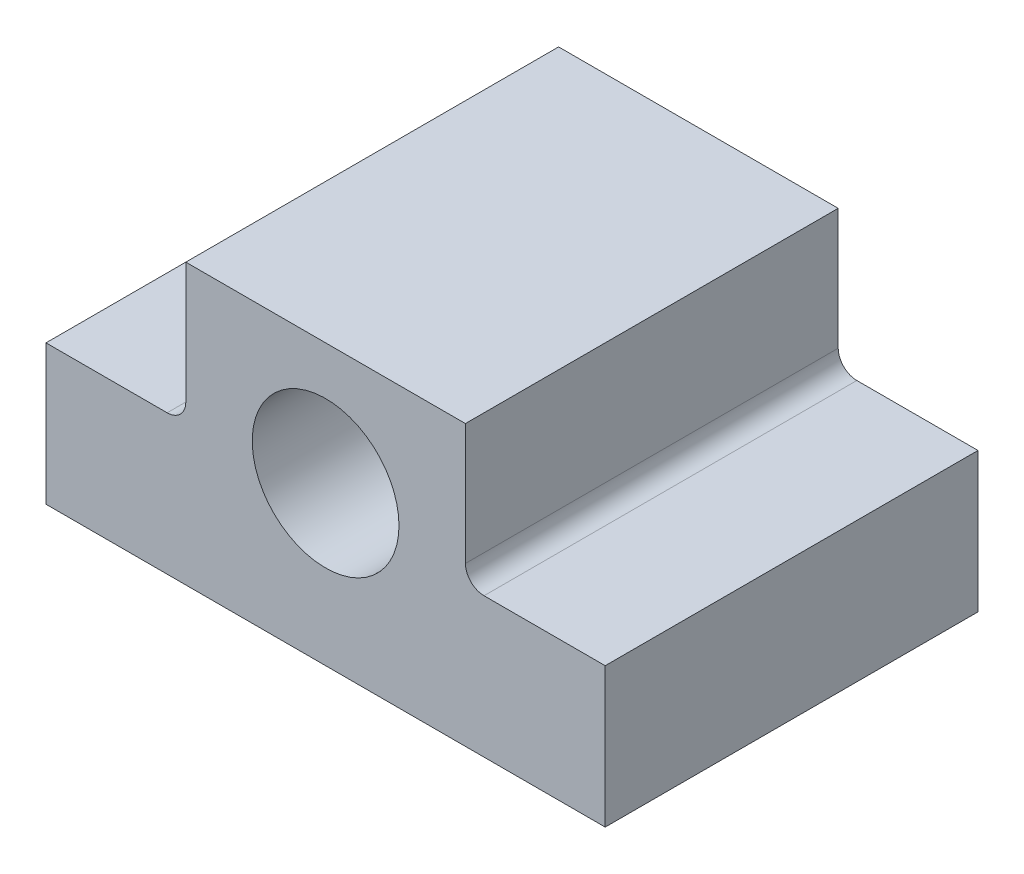
ISO-10303-21;
HEADER;
FILE_DESCRIPTION(('STEP AP214'),'2;1');
FILE_NAME('part.step','',(''),(''),'','','');
FILE_SCHEMA(('AUTOMOTIVE_DESIGN { 1 0 10303 214 1 1 1 1 }'));
ENDSEC;
DATA;
#1=APPLICATION_CONTEXT('core data for automotive mechanical design processes');
#2=APPLICATION_PROTOCOL_DEFINITION('international standard','automotive_design',2000,#1);
#3=PRODUCT_CONTEXT('',#1,'mechanical');
#4=PRODUCT('Part','Part','',(#3));
#5=PRODUCT_RELATED_PRODUCT_CATEGORY('part','',(#4));
#6=PRODUCT_DEFINITION_FORMATION('','',#4);
#7=PRODUCT_DEFINITION_CONTEXT('part definition',#1,'design');
#8=PRODUCT_DEFINITION('design','',#6,#7);
#9=PRODUCT_DEFINITION_SHAPE('','',#8);
#10=(LENGTH_UNIT() NAMED_UNIT(*) SI_UNIT(.MILLI.,.METRE.));
#11=(NAMED_UNIT(*) PLANE_ANGLE_UNIT() SI_UNIT($,.RADIAN.));
#12=(NAMED_UNIT(*) SI_UNIT($,.STERADIAN.) SOLID_ANGLE_UNIT());
#13=UNCERTAINTY_MEASURE_WITH_UNIT(LENGTH_MEASURE(1.E-05),#10,'distance_accuracy_value','');
#14=(GEOMETRIC_REPRESENTATION_CONTEXT(3) GLOBAL_UNCERTAINTY_ASSIGNED_CONTEXT((#13)) GLOBAL_UNIT_ASSIGNED_CONTEXT((#10,
#11,#12)) REPRESENTATION_CONTEXT('',''));
#15=CARTESIAN_POINT('',(0.,0.,0.));
#16=DIRECTION('',(0.,0.,1.));
#17=DIRECTION('',(1.,0.,0.));
#18=AXIS2_PLACEMENT_3D('',#15,#16,#17);
#19=CARTESIAN_POINT('',(0.,0.,12.7));
#20=DIRECTION('',(0.,0.,1.));
#21=DIRECTION('',(1.,0.,0.));
#22=AXIS2_PLACEMENT_3D('',#19,#20,#21);
#23=PLANE('',#22);
#24=DIRECTION('',(0.,-1.,0.));
#25=VECTOR('',#24,1.);
#26=CARTESIAN_POINT('',(-19.05,9.525,12.7));
#27=LINE('',#26,#25);
#28=CARTESIAN_POINT('',(-19.05,9.525,12.7));
#29=VERTEX_POINT('',#28);
#30=CARTESIAN_POINT('',(-19.05,0.,12.7));
#31=VERTEX_POINT('',#30);
#32=EDGE_CURVE('E121',#29,#31,#27,.T.);
#33=ORIENTED_EDGE('',*,*,#32,.T.);
#34=DIRECTION('',(1.,0.,0.));
#35=VECTOR('',#34,1.);
#36=CARTESIAN_POINT('',(-19.05,0.,12.7));
#37=LINE('',#36,#35);
#38=CARTESIAN_POINT('',(19.05,0.,12.7));
#39=VERTEX_POINT('',#38);
#40=EDGE_CURVE('E110',#31,#39,#37,.T.);
#41=ORIENTED_EDGE('',*,*,#40,.T.);
#42=DIRECTION('',(0.,1.,0.));
#43=VECTOR('',#42,1.);
#44=CARTESIAN_POINT('',(19.05,0.,12.7));
#45=LINE('',#44,#43);
#46=CARTESIAN_POINT('',(19.05,9.525,12.7));
#47=VERTEX_POINT('',#46);
#48=EDGE_CURVE('E120',#39,#47,#45,.T.);
#49=ORIENTED_EDGE('',*,*,#48,.T.);
#50=DIRECTION('',(-1.,0.,0.));
#51=VECTOR('',#50,1.);
#52=CARTESIAN_POINT('',(19.05,9.525,12.7));
#53=LINE('',#52,#51);
#54=CARTESIAN_POINT('',(10.795,9.525,12.7));
#55=VERTEX_POINT('',#54);
#56=EDGE_CURVE('E158',#47,#55,#53,.T.);
#57=ORIENTED_EDGE('',*,*,#56,.T.);
#58=CARTESIAN_POINT('',(10.795,10.795,12.7));
#59=DIRECTION('',(0.,0.,1.));
#60=DIRECTION('',(1.,0.,0.));
#61=AXIS2_PLACEMENT_3D('',#58,#59,#60);
#62=CIRCLE('',#61,1.27);
#63=CARTESIAN_POINT('',(9.525,10.795,12.7));
#64=VERTEX_POINT('',#63);
#65=EDGE_CURVE('E151',#55,#64,#62,.F.);
#66=ORIENTED_EDGE('',*,*,#65,.T.);
#67=DIRECTION('',(0.,1.,0.));
#68=VECTOR('',#67,1.);
#69=CARTESIAN_POINT('',(9.525,9.525,12.7));
#70=LINE('',#69,#68);
#71=CARTESIAN_POINT('',(9.525,19.05,12.7));
#72=VERTEX_POINT('',#71);
#73=EDGE_CURVE('E155',#64,#72,#70,.T.);
#74=ORIENTED_EDGE('',*,*,#73,.T.);
#75=DIRECTION('',(-1.,0.,0.));
#76=VECTOR('',#75,1.);
#77=CARTESIAN_POINT('',(9.525,19.05,12.7));
#78=LINE('',#77,#76);
#79=CARTESIAN_POINT('',(-9.525,19.05,12.7));
#80=VERTEX_POINT('',#79);
#81=EDGE_CURVE('E168',#72,#80,#78,.T.);
#82=ORIENTED_EDGE('',*,*,#81,.T.);
#83=DIRECTION('',(0.,-1.,0.));
#84=VECTOR('',#83,1.);
#85=CARTESIAN_POINT('',(-9.525,19.05,12.7));
#86=LINE('',#85,#84);
#87=CARTESIAN_POINT('',(-9.525,10.795,12.7));
#88=VERTEX_POINT('',#87);
#89=EDGE_CURVE('E207',#80,#88,#86,.T.);
#90=ORIENTED_EDGE('',*,*,#89,.T.);
#91=CARTESIAN_POINT('',(-10.795,10.795,12.7));
#92=DIRECTION('',(0.,0.,1.));
#93=DIRECTION('',(1.,0.,0.));
#94=AXIS2_PLACEMENT_3D('',#91,#92,#93);
#95=CIRCLE('',#94,1.27);
#96=CARTESIAN_POINT('',(-10.795,9.525,12.7));
#97=VERTEX_POINT('',#96);
#98=EDGE_CURVE('E11',#88,#97,#95,.F.);
#99=ORIENTED_EDGE('',*,*,#98,.T.);
#100=DIRECTION('',(-1.,0.,0.));
#101=VECTOR('',#100,1.);
#102=CARTESIAN_POINT('',(-9.525,9.525,12.7));
#103=LINE('',#102,#101);
#104=EDGE_CURVE('E126',#97,#29,#103,.T.);
#105=ORIENTED_EDGE('',*,*,#104,.T.);
#106=EDGE_LOOP('',(#33,#41,#49,#57,#66,#74,#82,#90,#99,#105));
#107=FACE_BOUND('',#106,.T.);
#108=CARTESIAN_POINT('',(0.,10.7644995508475,12.7));
#109=DIRECTION('',(0.,0.,1.));
#110=DIRECTION('',(1.,0.,0.));
#111=AXIS2_PLACEMENT_3D('',#108,#109,#110);
#112=CIRCLE('',#111,5.);
#113=CARTESIAN_POINT('',(5.,10.7644995508475,12.7));
#114=VERTEX_POINT('',#113);
#115=EDGE_CURVE('E214',#114,#114,#112,.T.);
#116=ORIENTED_EDGE('',*,*,#115,.F.);
#117=EDGE_LOOP('',(#116));
#118=FACE_BOUND('',#117,.T.);
#119=ADVANCED_FACE('F33',(#107,#118),#23,.T.);
#120=CARTESIAN_POINT('',(0.,0.,-12.7));
#121=DIRECTION('',(0.,0.,1.));
#122=DIRECTION('',(1.,0.,0.));
#123=AXIS2_PLACEMENT_3D('',#120,#121,#122);
#124=PLANE('',#123);
#125=DIRECTION('',(0.,-1.,0.));
#126=VECTOR('',#125,1.);
#127=CARTESIAN_POINT('',(-19.05,9.525,-12.7));
#128=LINE('',#127,#126);
#129=CARTESIAN_POINT('',(-19.05,9.525,-12.7));
#130=VERTEX_POINT('',#129);
#131=CARTESIAN_POINT('',(-19.05,0.,-12.7));
#132=VERTEX_POINT('',#131);
#133=EDGE_CURVE('E134',#130,#132,#128,.T.);
#134=ORIENTED_EDGE('',*,*,#133,.F.);
#135=DIRECTION('',(-1.,0.,0.));
#136=VECTOR('',#135,1.);
#137=CARTESIAN_POINT('',(-9.525,9.525,-12.7));
#138=LINE('',#137,#136);
#139=CARTESIAN_POINT('',(-10.795,9.525,-12.7));
#140=VERTEX_POINT('',#139);
#141=EDGE_CURVE('E130',#140,#130,#138,.T.);
#142=ORIENTED_EDGE('',*,*,#141,.F.);
#143=CARTESIAN_POINT('',(-10.795,10.795,-12.7));
#144=DIRECTION('',(0.,0.,1.));
#145=DIRECTION('',(1.,0.,0.));
#146=AXIS2_PLACEMENT_3D('',#143,#144,#145);
#147=CIRCLE('',#146,1.27);
#148=CARTESIAN_POINT('',(-9.525,10.795,-12.7));
#149=VERTEX_POINT('',#148);
#150=EDGE_CURVE('E41',#140,#149,#147,.T.);
#151=ORIENTED_EDGE('',*,*,#150,.T.);
#152=DIRECTION('',(0.,-1.,0.));
#153=VECTOR('',#152,1.);
#154=CARTESIAN_POINT('',(-9.525,19.05,-12.7));
#155=LINE('',#154,#153);
#156=CARTESIAN_POINT('',(-9.525,19.05,-12.7));
#157=VERTEX_POINT('',#156);
#158=EDGE_CURVE('E192',#157,#149,#155,.T.);
#159=ORIENTED_EDGE('',*,*,#158,.F.);
#160=DIRECTION('',(-1.,0.,0.));
#161=VECTOR('',#160,1.);
#162=CARTESIAN_POINT('',(9.525,19.05,-12.7));
#163=LINE('',#162,#161);
#164=CARTESIAN_POINT('',(9.525,19.05,-12.7));
#165=VERTEX_POINT('',#164);
#166=EDGE_CURVE('E185',#165,#157,#163,.T.);
#167=ORIENTED_EDGE('',*,*,#166,.F.);
#168=DIRECTION('',(0.,1.,0.));
#169=VECTOR('',#168,1.);
#170=CARTESIAN_POINT('',(9.525,9.525,-12.7));
#171=LINE('',#170,#169);
#172=CARTESIAN_POINT('',(9.525,10.795,-12.7));
#173=VERTEX_POINT('',#172);
#174=EDGE_CURVE('E178',#173,#165,#171,.T.);
#175=ORIENTED_EDGE('',*,*,#174,.F.);
#176=CARTESIAN_POINT('',(10.795,10.795,-12.7));
#177=DIRECTION('',(0.,0.,1.));
#178=DIRECTION('',(1.,0.,0.));
#179=AXIS2_PLACEMENT_3D('',#176,#177,#178);
#180=CIRCLE('',#179,1.27);
#181=CARTESIAN_POINT('',(10.795,9.525,-12.7));
#182=VERTEX_POINT('',#181);
#183=EDGE_CURVE('E149',#173,#182,#180,.T.);
#184=ORIENTED_EDGE('',*,*,#183,.T.);
#185=DIRECTION('',(-1.,0.,0.));
#186=VECTOR('',#185,1.);
#187=CARTESIAN_POINT('',(19.05,9.525,-12.7));
#188=LINE('',#187,#186);
#189=CARTESIAN_POINT('',(19.05,9.525,-12.7));
#190=VERTEX_POINT('',#189);
#191=EDGE_CURVE('E176',#190,#182,#188,.T.);
#192=ORIENTED_EDGE('',*,*,#191,.F.);
#193=DIRECTION('',(0.,1.,0.));
#194=VECTOR('',#193,1.);
#195=CARTESIAN_POINT('',(19.05,0.,-12.7));
#196=LINE('',#195,#194);
#197=CARTESIAN_POINT('',(19.05,0.,-12.7));
#198=VERTEX_POINT('',#197);
#199=EDGE_CURVE('E183',#198,#190,#196,.T.);
#200=ORIENTED_EDGE('',*,*,#199,.F.);
#201=DIRECTION('',(1.,0.,0.));
#202=VECTOR('',#201,1.);
#203=CARTESIAN_POINT('',(-19.05,0.,-12.7));
#204=LINE('',#203,#202);
#205=EDGE_CURVE('E187',#132,#198,#204,.T.);
#206=ORIENTED_EDGE('',*,*,#205,.F.);
#207=EDGE_LOOP('',(#134,#142,#151,#159,#167,#175,#184,#192,#200,#206));
#208=FACE_BOUND('',#207,.T.);
#209=CARTESIAN_POINT('',(0.,10.7644995508475,-12.7));
#210=DIRECTION('',(0.,0.,1.));
#211=DIRECTION('',(1.,0.,0.));
#212=AXIS2_PLACEMENT_3D('',#209,#210,#211);
#213=CIRCLE('',#212,5.);
#214=CARTESIAN_POINT('',(5.,10.7644995508475,-12.7));
#215=VERTEX_POINT('',#214);
#216=EDGE_CURVE('E220',#215,#215,#213,.T.);
#217=ORIENTED_EDGE('',*,*,#216,.T.);
#218=EDGE_LOOP('',(#217));
#219=FACE_BOUND('',#218,.T.);
#220=ADVANCED_FACE('F173',(#208,#219),#124,.F.);
#221=CARTESIAN_POINT('',(-19.05,9.525,12.7));
#222=DIRECTION('',(1.,0.,0.));
#223=DIRECTION('',(0.,0.,-1.));
#224=AXIS2_PLACEMENT_3D('',#221,#222,#223);
#225=PLANE('',#224);
#226=ORIENTED_EDGE('',*,*,#133,.T.);
#227=DIRECTION('',(0.,0.,-1.));
#228=VECTOR('',#227,1.);
#229=CARTESIAN_POINT('',(-19.05,0.,12.7));
#230=LINE('',#229,#228);
#231=EDGE_CURVE('E114',#31,#132,#230,.T.);
#232=ORIENTED_EDGE('',*,*,#231,.F.);
#233=ORIENTED_EDGE('',*,*,#32,.F.);
#234=DIRECTION('',(0.,0.,-1.));
#235=VECTOR('',#234,1.);
#236=CARTESIAN_POINT('',(-19.05,9.525,12.7));
#237=LINE('',#236,#235);
#238=EDGE_CURVE('E195',#29,#130,#237,.T.);
#239=ORIENTED_EDGE('',*,*,#238,.T.);
#240=EDGE_LOOP('',(#226,#232,#233,#239));
#241=FACE_BOUND('',#240,.T.);
#242=ADVANCED_FACE('F132',(#241),#225,.F.);
#243=CARTESIAN_POINT('',(-19.05,0.,12.7));
#244=DIRECTION('',(0.,1.,0.));
#245=DIRECTION('',(0.,0.,1.));
#246=AXIS2_PLACEMENT_3D('',#243,#244,#245);
#247=PLANE('',#246);
#248=ORIENTED_EDGE('',*,*,#205,.T.);
#249=DIRECTION('',(0.,0.,-1.));
#250=VECTOR('',#249,1.);
#251=CARTESIAN_POINT('',(19.05,0.,12.7));
#252=LINE('',#251,#250);
#253=EDGE_CURVE('E117',#39,#198,#252,.T.);
#254=ORIENTED_EDGE('',*,*,#253,.F.);
#255=ORIENTED_EDGE('',*,*,#40,.F.);
#256=ORIENTED_EDGE('',*,*,#231,.T.);
#257=EDGE_LOOP('',(#248,#254,#255,#256));
#258=FACE_BOUND('',#257,.T.);
#259=ADVANCED_FACE('F112',(#258),#247,.F.);
#260=CARTESIAN_POINT('',(19.05,0.,12.7));
#261=DIRECTION('',(-1.,0.,0.));
#262=DIRECTION('',(0.,0.,1.));
#263=AXIS2_PLACEMENT_3D('',#260,#261,#262);
#264=PLANE('',#263);
#265=ORIENTED_EDGE('',*,*,#199,.T.);
#266=DIRECTION('',(0.,0.,-1.));
#267=VECTOR('',#266,1.);
#268=CARTESIAN_POINT('',(19.05,9.525,12.7));
#269=LINE('',#268,#267);
#270=EDGE_CURVE('E140',#47,#190,#269,.T.);
#271=ORIENTED_EDGE('',*,*,#270,.F.);
#272=ORIENTED_EDGE('',*,*,#48,.F.);
#273=ORIENTED_EDGE('',*,*,#253,.T.);
#274=EDGE_LOOP('',(#265,#271,#272,#273));
#275=FACE_BOUND('',#274,.T.);
#276=ADVANCED_FACE('F216',(#275),#264,.F.);
#277=CARTESIAN_POINT('',(19.05,9.525,12.7));
#278=DIRECTION('',(0.,-1.,0.));
#279=DIRECTION('',(0.,0.,-1.));
#280=AXIS2_PLACEMENT_3D('',#277,#278,#279);
#281=PLANE('',#280);
#282=ORIENTED_EDGE('',*,*,#191,.T.);
#283=DIRECTION('',(0.,0.,-1.));
#284=VECTOR('',#283,1.);
#285=CARTESIAN_POINT('',(10.795,9.525,12.7));
#286=LINE('',#285,#284);
#287=EDGE_CURVE('E138',#182,#55,#286,.F.);
#288=ORIENTED_EDGE('',*,*,#287,.T.);
#289=ORIENTED_EDGE('',*,*,#56,.F.);
#290=ORIENTED_EDGE('',*,*,#270,.T.);
#291=EDGE_LOOP('',(#282,#288,#289,#290));
#292=FACE_BOUND('',#291,.T.);
#293=ADVANCED_FACE('F181',(#292),#281,.F.);
#294=CARTESIAN_POINT('',(9.525,9.525,12.7));
#295=DIRECTION('',(-1.,0.,0.));
#296=DIRECTION('',(0.,0.,1.));
#297=AXIS2_PLACEMENT_3D('',#294,#295,#296);
#298=PLANE('',#297);
#299=ORIENTED_EDGE('',*,*,#73,.F.);
#300=DIRECTION('',(0.,0.,-1.));
#301=VECTOR('',#300,1.);
#302=CARTESIAN_POINT('',(9.525,10.795,-12.7));
#303=LINE('',#302,#301);
#304=EDGE_CURVE('E135',#64,#173,#303,.T.);
#305=ORIENTED_EDGE('',*,*,#304,.T.);
#306=ORIENTED_EDGE('',*,*,#174,.T.);
#307=DIRECTION('',(0.,0.,-1.));
#308=VECTOR('',#307,1.);
#309=CARTESIAN_POINT('',(9.525,19.05,12.7));
#310=LINE('',#309,#308);
#311=EDGE_CURVE('E166',#72,#165,#310,.T.);
#312=ORIENTED_EDGE('',*,*,#311,.F.);
#313=EDGE_LOOP('',(#299,#305,#306,#312));
#314=FACE_BOUND('',#313,.T.);
#315=ADVANCED_FACE('F163',(#314),#298,.F.);
#316=CARTESIAN_POINT('',(9.525,19.05,12.7));
#317=DIRECTION('',(0.,-1.,0.));
#318=DIRECTION('',(0.,0.,-1.));
#319=AXIS2_PLACEMENT_3D('',#316,#317,#318);
#320=PLANE('',#319);
#321=ORIENTED_EDGE('',*,*,#166,.T.);
#322=DIRECTION('',(0.,0.,-1.));
#323=VECTOR('',#322,1.);
#324=CARTESIAN_POINT('',(-9.525,19.05,12.7));
#325=LINE('',#324,#323);
#326=EDGE_CURVE('E197',#80,#157,#325,.T.);
#327=ORIENTED_EDGE('',*,*,#326,.F.);
#328=ORIENTED_EDGE('',*,*,#81,.F.);
#329=ORIENTED_EDGE('',*,*,#311,.T.);
#330=EDGE_LOOP('',(#321,#327,#328,#329));
#331=FACE_BOUND('',#330,.T.);
#332=ADVANCED_FACE('F201',(#331),#320,.F.);
#333=CARTESIAN_POINT('',(-9.525,19.05,12.7));
#334=DIRECTION('',(1.,0.,0.));
#335=DIRECTION('',(0.,0.,-1.));
#336=AXIS2_PLACEMENT_3D('',#333,#334,#335);
#337=PLANE('',#336);
#338=ORIENTED_EDGE('',*,*,#158,.T.);
#339=DIRECTION('',(0.,0.,-1.));
#340=VECTOR('',#339,1.);
#341=CARTESIAN_POINT('',(-9.525,10.795,12.7));
#342=LINE('',#341,#340);
#343=EDGE_CURVE('E48',#149,#88,#342,.F.);
#344=ORIENTED_EDGE('',*,*,#343,.T.);
#345=ORIENTED_EDGE('',*,*,#89,.F.);
#346=ORIENTED_EDGE('',*,*,#326,.T.);
#347=EDGE_LOOP('',(#338,#344,#345,#346));
#348=FACE_BOUND('',#347,.T.);
#349=ADVANCED_FACE('F203',(#348),#337,.F.);
#350=CARTESIAN_POINT('',(-9.525,9.525,12.7));
#351=DIRECTION('',(0.,-1.,0.));
#352=DIRECTION('',(0.,0.,-1.));
#353=AXIS2_PLACEMENT_3D('',#350,#351,#352);
#354=PLANE('',#353);
#355=ORIENTED_EDGE('',*,*,#104,.F.);
#356=DIRECTION('',(0.,0.,-1.));
#357=VECTOR('',#356,1.);
#358=CARTESIAN_POINT('',(-10.795,9.525,-12.7));
#359=LINE('',#358,#357);
#360=EDGE_CURVE('E145',#97,#140,#359,.T.);
#361=ORIENTED_EDGE('',*,*,#360,.T.);
#362=ORIENTED_EDGE('',*,*,#141,.T.);
#363=ORIENTED_EDGE('',*,*,#238,.F.);
#364=EDGE_LOOP('',(#355,#361,#362,#363));
#365=FACE_BOUND('',#364,.T.);
#366=ADVANCED_FACE('F209',(#365),#354,.F.);
#367=CARTESIAN_POINT('',(0.,10.7644995508475,12.7));
#368=DIRECTION('',(0.,0.,-1.));
#369=DIRECTION('',(-1.,0.,0.));
#370=AXIS2_PLACEMENT_3D('',#367,#368,#369);
#371=CYLINDRICAL_SURFACE('',#370,5.);
#372=ORIENTED_EDGE('',*,*,#115,.T.);
#373=EDGE_LOOP('',(#372));
#374=FACE_BOUND('',#373,.T.);
#375=ORIENTED_EDGE('',*,*,#216,.F.);
#376=EDGE_LOOP('',(#375));
#377=FACE_BOUND('',#376,.T.);
#378=ADVANCED_FACE('F226',(#374,#377),#371,.F.);
#379=CARTESIAN_POINT('',(10.795,10.795,12.7));
#380=DIRECTION('',(0.,0.,1.));
#381=DIRECTION('',(1.,0.,0.));
#382=AXIS2_PLACEMENT_3D('',#379,#380,#381);
#383=CYLINDRICAL_SURFACE('',#382,1.27);
#384=ORIENTED_EDGE('',*,*,#65,.F.);
#385=ORIENTED_EDGE('',*,*,#287,.F.);
#386=ORIENTED_EDGE('',*,*,#183,.F.);
#387=ORIENTED_EDGE('',*,*,#304,.F.);
#388=EDGE_LOOP('',(#384,#385,#386,#387));
#389=FACE_BOUND('',#388,.T.);
#390=ADVANCED_FACE('F170',(#389),#383,.F.);
#391=CARTESIAN_POINT('',(-10.795,10.795,12.7));
#392=DIRECTION('',(0.,0.,1.));
#393=DIRECTION('',(1.,0.,0.));
#394=AXIS2_PLACEMENT_3D('',#391,#392,#393);
#395=CYLINDRICAL_SURFACE('',#394,1.27);
#396=ORIENTED_EDGE('',*,*,#98,.F.);
#397=ORIENTED_EDGE('',*,*,#343,.F.);
#398=ORIENTED_EDGE('',*,*,#150,.F.);
#399=ORIENTED_EDGE('',*,*,#360,.F.);
#400=EDGE_LOOP('',(#396,#397,#398,#399));
#401=FACE_BOUND('',#400,.T.);
#402=ADVANCED_FACE('F35',(#401),#395,.F.);
#403=CLOSED_SHELL('',(#119,#220,#242,#259,#276,#293,#315,#332,#349,#366,#378,#390,#402));
#404=MANIFOLD_SOLID_BREP('B2',#403);
#405=ADVANCED_BREP_SHAPE_REPRESENTATION('',(#18,#404),#14);
#406=SHAPE_DEFINITION_REPRESENTATION(#9,#405);
ENDSEC;
END-ISO-10303-21;
